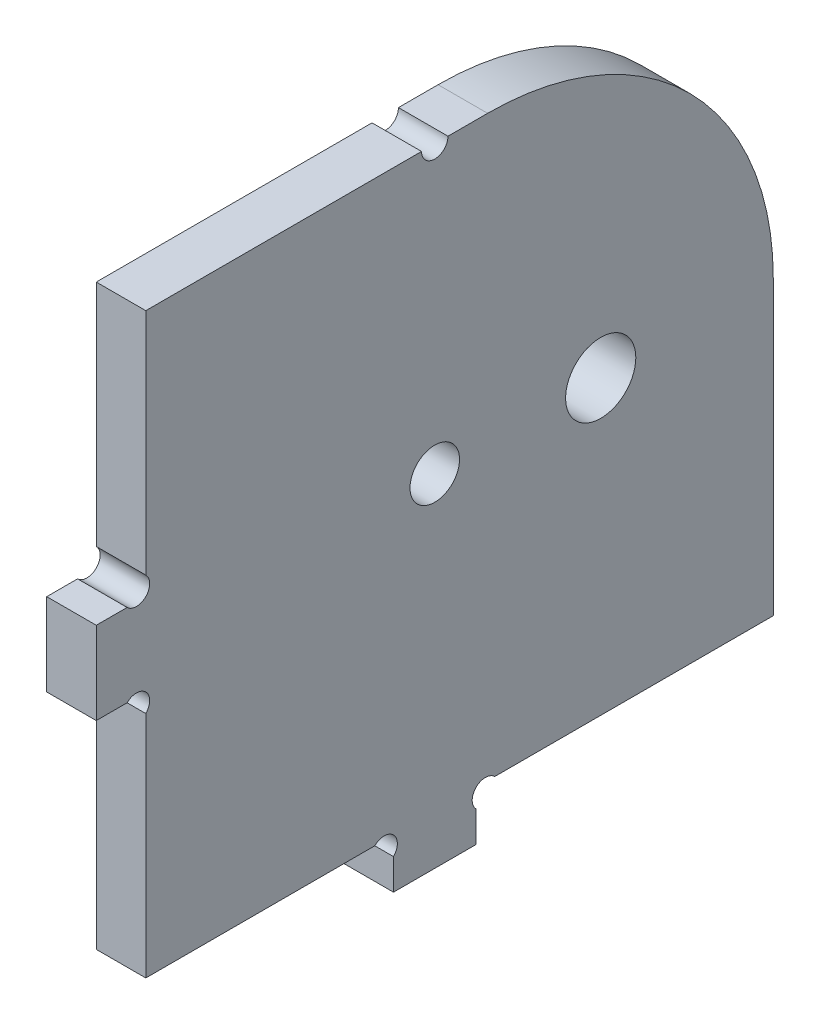
ISO-10303-21;
HEADER;
FILE_DESCRIPTION(('STEP AP214'),'2;1');
FILE_NAME('part.step','',(''),(''),'','','');
FILE_SCHEMA(('AUTOMOTIVE_DESIGN { 1 0 10303 214 1 1 1 1 }'));
ENDSEC;
DATA;
#1=APPLICATION_CONTEXT('core data for automotive mechanical design processes');
#2=APPLICATION_PROTOCOL_DEFINITION('international standard','automotive_design',2000,#1);
#3=PRODUCT_CONTEXT('',#1,'mechanical');
#4=PRODUCT('Part','Part','',(#3));
#5=PRODUCT_RELATED_PRODUCT_CATEGORY('part','',(#4));
#6=PRODUCT_DEFINITION_FORMATION('','',#4);
#7=PRODUCT_DEFINITION_CONTEXT('part definition',#1,'design');
#8=PRODUCT_DEFINITION('design','',#6,#7);
#9=PRODUCT_DEFINITION_SHAPE('','',#8);
#10=(LENGTH_UNIT() NAMED_UNIT(*) SI_UNIT(.MILLI.,.METRE.));
#11=(NAMED_UNIT(*) PLANE_ANGLE_UNIT() SI_UNIT($,.RADIAN.));
#12=(NAMED_UNIT(*) SI_UNIT($,.STERADIAN.) SOLID_ANGLE_UNIT());
#13=UNCERTAINTY_MEASURE_WITH_UNIT(LENGTH_MEASURE(1.E-05),#10,'distance_accuracy_value','');
#14=(GEOMETRIC_REPRESENTATION_CONTEXT(3) GLOBAL_UNCERTAINTY_ASSIGNED_CONTEXT((#13)) GLOBAL_UNIT_ASSIGNED_CONTEXT((#10,
#11,#12)) REPRESENTATION_CONTEXT('',''));
#15=CARTESIAN_POINT('',(0.,0.,0.));
#16=DIRECTION('',(0.,0.,1.));
#17=DIRECTION('',(1.,0.,0.));
#18=AXIS2_PLACEMENT_3D('',#15,#16,#17);
#19=CARTESIAN_POINT('',(6.,4.86862915010152,-47.1313708498985));
#20=DIRECTION('',(1.,0.,0.));
#21=DIRECTION('',(0.,0.,-1.));
#22=AXIS2_PLACEMENT_3D('',#19,#20,#21);
#23=PLANE('',#22);
#24=CARTESIAN_POINT('',(6.,41.4,-41.));
#25=DIRECTION('',(1.,0.,0.));
#26=DIRECTION('',(0.,0.,-1.));
#27=AXIS2_PLACEMENT_3D('',#24,#25,#26);
#28=CIRCLE('',#27,3.);
#29=CARTESIAN_POINT('',(6.,41.4,-44.));
#30=VERTEX_POINT('',#29);
#31=EDGE_CURVE('E199',#30,#30,#28,.T.);
#32=ORIENTED_EDGE('',*,*,#31,.F.);
#33=EDGE_LOOP('',(#32));
#34=FACE_BOUND('',#33,.T.);
#35=CARTESIAN_POINT('',(6.,4.86862915010152,-47.1313708498985));
#36=DIRECTION('',(-1.,0.,0.));
#37=DIRECTION('',(0.,0.,-1.));
#38=AXIS2_PLACEMENT_3D('',#35,#36,#37);
#39=CIRCLE('',#38,1.60000000000001);
#40=CARTESIAN_POINT('',(6.,3.73725830020304,-46.));
#41=VERTEX_POINT('',#40);
#42=CARTESIAN_POINT('',(6.,6.,-48.262741699797));
#43=VERTEX_POINT('',#42);
#44=EDGE_CURVE('E232',#41,#43,#39,.T.);
#45=ORIENTED_EDGE('',*,*,#44,.T.);
#46=DIRECTION('',(0.,0.,-1.));
#47=VECTOR('',#46,1.);
#48=CARTESIAN_POINT('',(6.,6.,-82.));
#49=LINE('',#48,#47);
#50=CARTESIAN_POINT('',(6.,6.,-82.));
#51=VERTEX_POINT('',#50);
#52=EDGE_CURVE('E125',#43,#51,#49,.T.);
#53=ORIENTED_EDGE('',*,*,#52,.T.);
#54=DIRECTION('',(0.,1.,0.));
#55=VECTOR('',#54,1.);
#56=CARTESIAN_POINT('',(6.,41.4,-82.));
#57=LINE('',#56,#55);
#58=CARTESIAN_POINT('',(6.,41.4,-82.));
#59=VERTEX_POINT('',#58);
#60=EDGE_CURVE('E280',#51,#59,#57,.T.);
#61=ORIENTED_EDGE('',*,*,#60,.T.);
#62=CARTESIAN_POINT('',(6.,41.4,-47.4));
#63=DIRECTION('',(1.,0.,0.));
#64=DIRECTION('',(0.,0.,-1.));
#65=AXIS2_PLACEMENT_3D('',#62,#63,#64);
#66=CIRCLE('',#65,34.6);
#67=CARTESIAN_POINT('',(6.,76.,-47.4));
#68=VERTEX_POINT('',#67);
#69=EDGE_CURVE('E299',#59,#68,#66,.T.);
#70=ORIENTED_EDGE('',*,*,#69,.T.);
#71=DIRECTION('',(0.,0.,1.));
#72=VECTOR('',#71,1.);
#73=CARTESIAN_POINT('',(6.,76.,-42.6));
#74=LINE('',#73,#72);
#75=CARTESIAN_POINT('',(6.,76.,-42.6));
#76=VERTEX_POINT('',#75);
#77=EDGE_CURVE('E296',#68,#76,#74,.T.);
#78=ORIENTED_EDGE('',*,*,#77,.T.);
#79=CARTESIAN_POINT('',(6.,76.,-41.));
#80=DIRECTION('',(-1.,0.,0.));
#81=DIRECTION('',(0.,0.,-1.));
#82=AXIS2_PLACEMENT_3D('',#79,#80,#81);
#83=CIRCLE('',#82,1.6);
#84=CARTESIAN_POINT('',(6.,76.,-39.4));
#85=VERTEX_POINT('',#84);
#86=EDGE_CURVE('E298',#76,#85,#83,.T.);
#87=ORIENTED_EDGE('',*,*,#86,.T.);
#88=DIRECTION('',(0.,0.,1.));
#89=VECTOR('',#88,1.);
#90=CARTESIAN_POINT('',(6.,76.,-6.));
#91=LINE('',#90,#89);
#92=CARTESIAN_POINT('',(6.,76.,-6.));
#93=VERTEX_POINT('',#92);
#94=EDGE_CURVE('E301',#85,#93,#91,.T.);
#95=ORIENTED_EDGE('',*,*,#94,.T.);
#96=DIRECTION('',(0.,-1.,0.));
#97=VECTOR('',#96,1.);
#98=CARTESIAN_POINT('',(6.,48.2627416997972,-6.));
#99=LINE('',#98,#97);
#100=CARTESIAN_POINT('',(6.,48.2627416997972,-6.));
#101=VERTEX_POINT('',#100);
#102=EDGE_CURVE('E307',#93,#101,#99,.T.);
#103=ORIENTED_EDGE('',*,*,#102,.T.);
#104=CARTESIAN_POINT('',(6.,47.1313708498986,-4.86862915010136));
#105=DIRECTION('',(-1.,0.,0.));
#106=DIRECTION('',(0.,0.,1.));
#107=AXIS2_PLACEMENT_3D('',#104,#105,#106);
#108=CIRCLE('',#107,1.60000000000023);
#109=CARTESIAN_POINT('',(6.,46.,-3.73725830020272));
#110=VERTEX_POINT('',#109);
#111=EDGE_CURVE('E309',#101,#110,#108,.T.);
#112=ORIENTED_EDGE('',*,*,#111,.T.);
#113=DIRECTION('',(0.,0.,1.));
#114=VECTOR('',#113,1.);
#115=CARTESIAN_POINT('',(6.,46.,0.));
#116=LINE('',#115,#114);
#117=CARTESIAN_POINT('',(6.,46.,0.));
#118=VERTEX_POINT('',#117);
#119=EDGE_CURVE('E311',#110,#118,#116,.T.);
#120=ORIENTED_EDGE('',*,*,#119,.T.);
#121=DIRECTION('',(0.,-1.,0.));
#122=VECTOR('',#121,1.);
#123=CARTESIAN_POINT('',(6.,36.,0.));
#124=LINE('',#123,#122);
#125=CARTESIAN_POINT('',(6.,36.,0.));
#126=VERTEX_POINT('',#125);
#127=EDGE_CURVE('E313',#118,#126,#124,.T.);
#128=ORIENTED_EDGE('',*,*,#127,.T.);
#129=DIRECTION('',(0.,0.,-1.));
#130=VECTOR('',#129,1.);
#131=CARTESIAN_POINT('',(6.,36.,-3.73725830020257));
#132=LINE('',#131,#130);
#133=CARTESIAN_POINT('',(6.,36.,-3.73725830020257));
#134=VERTEX_POINT('',#133);
#135=EDGE_CURVE('E315',#126,#134,#132,.T.);
#136=ORIENTED_EDGE('',*,*,#135,.T.);
#137=CARTESIAN_POINT('',(6.,34.8686291501013,-4.86862915010128));
#138=DIRECTION('',(-1.,0.,0.));
#139=DIRECTION('',(0.,0.,-1.));
#140=AXIS2_PLACEMENT_3D('',#137,#138,#139);
#141=CIRCLE('',#140,1.60000000000033);
#142=CARTESIAN_POINT('',(6.,33.7372583002026,-6.));
#143=VERTEX_POINT('',#142);
#144=EDGE_CURVE('E317',#134,#143,#141,.T.);
#145=ORIENTED_EDGE('',*,*,#144,.T.);
#146=DIRECTION('',(0.,-1.,0.));
#147=VECTOR('',#146,1.);
#148=CARTESIAN_POINT('',(6.,6.,-6.));
#149=LINE('',#148,#147);
#150=CARTESIAN_POINT('',(6.,6.,-6.));
#151=VERTEX_POINT('',#150);
#152=EDGE_CURVE('E319',#143,#151,#149,.T.);
#153=ORIENTED_EDGE('',*,*,#152,.T.);
#154=DIRECTION('',(0.,0.,-1.));
#155=VECTOR('',#154,1.);
#156=CARTESIAN_POINT('',(6.,6.,-33.7372583002031));
#157=LINE('',#156,#155);
#158=CARTESIAN_POINT('',(6.,6.,-33.7372583002031));
#159=VERTEX_POINT('',#158);
#160=EDGE_CURVE('E321',#151,#159,#157,.T.);
#161=ORIENTED_EDGE('',*,*,#160,.T.);
#162=CARTESIAN_POINT('',(6.,4.86862915010151,-34.8686291501015));
#163=DIRECTION('',(-1.,0.,0.));
#164=DIRECTION('',(0.,0.,1.));
#165=AXIS2_PLACEMENT_3D('',#162,#163,#164);
#166=CIRCLE('',#165,1.60000000000001);
#167=CARTESIAN_POINT('',(6.,3.73725830020304,-36.));
#168=VERTEX_POINT('',#167);
#169=EDGE_CURVE('E177',#159,#168,#166,.T.);
#170=ORIENTED_EDGE('',*,*,#169,.T.);
#171=DIRECTION('',(0.,-1.,0.));
#172=VECTOR('',#171,1.);
#173=CARTESIAN_POINT('',(6.,0.,-36.));
#174=LINE('',#173,#172);
#175=CARTESIAN_POINT('',(6.,0.,-36.));
#176=VERTEX_POINT('',#175);
#177=EDGE_CURVE('E171',#168,#176,#174,.T.);
#178=ORIENTED_EDGE('',*,*,#177,.T.);
#179=DIRECTION('',(0.,0.,-1.));
#180=VECTOR('',#179,1.);
#181=CARTESIAN_POINT('',(6.,0.,-46.));
#182=LINE('',#181,#180);
#183=CARTESIAN_POINT('',(6.,0.,-46.));
#184=VERTEX_POINT('',#183);
#185=EDGE_CURVE('E175',#176,#184,#182,.T.);
#186=ORIENTED_EDGE('',*,*,#185,.T.);
#187=DIRECTION('',(0.,1.,0.));
#188=VECTOR('',#187,1.);
#189=CARTESIAN_POINT('',(6.,3.73725830020304,-46.));
#190=LINE('',#189,#188);
#191=EDGE_CURVE('E49',#184,#41,#190,.T.);
#192=ORIENTED_EDGE('',*,*,#191,.T.);
#193=EDGE_LOOP('',(#45,#53,#61,#70,#78,#87,#95,#103,#112,#120,#128,#136,#145,#153,#161,#170,
#178,#186,#192));
#194=FACE_BOUND('',#193,.T.);
#195=CARTESIAN_POINT('',(6.,41.4,-61.1));
#196=DIRECTION('',(1.,0.,0.));
#197=DIRECTION('',(0.,0.,-1.));
#198=AXIS2_PLACEMENT_3D('',#195,#196,#197);
#199=CIRCLE('',#198,4.25000000000001);
#200=CARTESIAN_POINT('',(6.,41.4,-65.35));
#201=VERTEX_POINT('',#200);
#202=EDGE_CURVE('E364',#201,#201,#199,.T.);
#203=ORIENTED_EDGE('',*,*,#202,.F.);
#204=EDGE_LOOP('',(#203));
#205=FACE_BOUND('',#204,.T.);
#206=ADVANCED_FACE('F32',(#34,#194,#205),#23,.T.);
#207=CARTESIAN_POINT('',(0.,4.86862915010152,-47.1313708498985));
#208=DIRECTION('',(1.,0.,0.));
#209=DIRECTION('',(0.,0.,-1.));
#210=AXIS2_PLACEMENT_3D('',#207,#208,#209);
#211=PLANE('',#210);
#212=CARTESIAN_POINT('',(0.,41.4,-41.));
#213=DIRECTION('',(1.,0.,0.));
#214=DIRECTION('',(0.,0.,-1.));
#215=AXIS2_PLACEMENT_3D('',#212,#213,#214);
#216=CIRCLE('',#215,3.);
#217=CARTESIAN_POINT('',(0.,41.4,-44.));
#218=VERTEX_POINT('',#217);
#219=EDGE_CURVE('E369',#218,#218,#216,.T.);
#220=ORIENTED_EDGE('',*,*,#219,.T.);
#221=EDGE_LOOP('',(#220));
#222=FACE_BOUND('',#221,.T.);
#223=CARTESIAN_POINT('',(0.,4.86862915010152,-47.1313708498985));
#224=DIRECTION('',(-1.,0.,0.));
#225=DIRECTION('',(0.,0.,-1.));
#226=AXIS2_PLACEMENT_3D('',#223,#224,#225);
#227=CIRCLE('',#226,1.60000000000001);
#228=CARTESIAN_POINT('',(0.,3.73725830020304,-46.));
#229=VERTEX_POINT('',#228);
#230=CARTESIAN_POINT('',(0.,6.,-48.262741699797));
#231=VERTEX_POINT('',#230);
#232=EDGE_CURVE('E195',#229,#231,#227,.T.);
#233=ORIENTED_EDGE('',*,*,#232,.F.);
#234=DIRECTION('',(0.,1.,0.));
#235=VECTOR('',#234,1.);
#236=CARTESIAN_POINT('',(0.,3.73725830020304,-46.));
#237=LINE('',#236,#235);
#238=CARTESIAN_POINT('',(0.,0.,-46.));
#239=VERTEX_POINT('',#238);
#240=EDGE_CURVE('E117',#239,#229,#237,.T.);
#241=ORIENTED_EDGE('',*,*,#240,.F.);
#242=DIRECTION('',(0.,0.,-1.));
#243=VECTOR('',#242,1.);
#244=CARTESIAN_POINT('',(0.,0.,-46.));
#245=LINE('',#244,#243);
#246=CARTESIAN_POINT('',(0.,0.,-36.));
#247=VERTEX_POINT('',#246);
#248=EDGE_CURVE('E111',#247,#239,#245,.T.);
#249=ORIENTED_EDGE('',*,*,#248,.F.);
#250=DIRECTION('',(0.,-1.,0.));
#251=VECTOR('',#250,1.);
#252=CARTESIAN_POINT('',(0.,0.,-36.));
#253=LINE('',#252,#251);
#254=CARTESIAN_POINT('',(0.,3.73725830020304,-36.));
#255=VERTEX_POINT('',#254);
#256=EDGE_CURVE('E185',#255,#247,#253,.T.);
#257=ORIENTED_EDGE('',*,*,#256,.F.);
#258=CARTESIAN_POINT('',(0.,4.86862915010151,-34.8686291501015));
#259=DIRECTION('',(-1.,0.,0.));
#260=DIRECTION('',(0.,0.,1.));
#261=AXIS2_PLACEMENT_3D('',#258,#259,#260);
#262=CIRCLE('',#261,1.60000000000001);
#263=CARTESIAN_POINT('',(0.,6.,-33.7372583002031));
#264=VERTEX_POINT('',#263);
#265=EDGE_CURVE('E227',#264,#255,#262,.T.);
#266=ORIENTED_EDGE('',*,*,#265,.F.);
#267=DIRECTION('',(0.,0.,-1.));
#268=VECTOR('',#267,1.);
#269=CARTESIAN_POINT('',(0.,6.,-33.7372583002031));
#270=LINE('',#269,#268);
#271=CARTESIAN_POINT('',(0.,6.,-6.));
#272=VERTEX_POINT('',#271);
#273=EDGE_CURVE('E225',#272,#264,#270,.T.);
#274=ORIENTED_EDGE('',*,*,#273,.F.);
#275=DIRECTION('',(0.,-1.,0.));
#276=VECTOR('',#275,1.);
#277=CARTESIAN_POINT('',(0.,6.,-6.));
#278=LINE('',#277,#276);
#279=CARTESIAN_POINT('',(0.,33.7372583002026,-6.));
#280=VERTEX_POINT('',#279);
#281=EDGE_CURVE('E223',#280,#272,#278,.T.);
#282=ORIENTED_EDGE('',*,*,#281,.F.);
#283=CARTESIAN_POINT('',(0.,34.8686291501013,-4.86862915010128));
#284=DIRECTION('',(-1.,0.,0.));
#285=DIRECTION('',(0.,0.,-1.));
#286=AXIS2_PLACEMENT_3D('',#283,#284,#285);
#287=CIRCLE('',#286,1.60000000000033);
#288=CARTESIAN_POINT('',(0.,36.,-3.73725830020257));
#289=VERTEX_POINT('',#288);
#290=EDGE_CURVE('E221',#289,#280,#287,.T.);
#291=ORIENTED_EDGE('',*,*,#290,.F.);
#292=DIRECTION('',(0.,0.,-1.));
#293=VECTOR('',#292,1.);
#294=CARTESIAN_POINT('',(0.,36.,-3.73725830020257));
#295=LINE('',#294,#293);
#296=CARTESIAN_POINT('',(0.,36.,0.));
#297=VERTEX_POINT('',#296);
#298=EDGE_CURVE('E219',#297,#289,#295,.T.);
#299=ORIENTED_EDGE('',*,*,#298,.F.);
#300=DIRECTION('',(0.,-1.,0.));
#301=VECTOR('',#300,1.);
#302=CARTESIAN_POINT('',(0.,36.,0.));
#303=LINE('',#302,#301);
#304=CARTESIAN_POINT('',(0.,46.,0.));
#305=VERTEX_POINT('',#304);
#306=EDGE_CURVE('E217',#305,#297,#303,.T.);
#307=ORIENTED_EDGE('',*,*,#306,.F.);
#308=DIRECTION('',(0.,0.,1.));
#309=VECTOR('',#308,1.);
#310=CARTESIAN_POINT('',(0.,46.,0.));
#311=LINE('',#310,#309);
#312=CARTESIAN_POINT('',(0.,46.,-3.73725830020272));
#313=VERTEX_POINT('',#312);
#314=EDGE_CURVE('E215',#313,#305,#311,.T.);
#315=ORIENTED_EDGE('',*,*,#314,.F.);
#316=CARTESIAN_POINT('',(0.,47.1313708498986,-4.86862915010136));
#317=DIRECTION('',(-1.,0.,0.));
#318=DIRECTION('',(0.,0.,1.));
#319=AXIS2_PLACEMENT_3D('',#316,#317,#318);
#320=CIRCLE('',#319,1.60000000000023);
#321=CARTESIAN_POINT('',(0.,48.2627416997972,-6.));
#322=VERTEX_POINT('',#321);
#323=EDGE_CURVE('E213',#322,#313,#320,.T.);
#324=ORIENTED_EDGE('',*,*,#323,.F.);
#325=DIRECTION('',(0.,-1.,0.));
#326=VECTOR('',#325,1.);
#327=CARTESIAN_POINT('',(0.,48.2627416997972,-6.));
#328=LINE('',#327,#326);
#329=CARTESIAN_POINT('',(0.,76.,-6.));
#330=VERTEX_POINT('',#329);
#331=EDGE_CURVE('E211',#330,#322,#328,.T.);
#332=ORIENTED_EDGE('',*,*,#331,.F.);
#333=DIRECTION('',(0.,0.,1.));
#334=VECTOR('',#333,1.);
#335=CARTESIAN_POINT('',(0.,76.,-6.));
#336=LINE('',#335,#334);
#337=CARTESIAN_POINT('',(0.,76.,-39.4));
#338=VERTEX_POINT('',#337);
#339=EDGE_CURVE('E209',#338,#330,#336,.T.);
#340=ORIENTED_EDGE('',*,*,#339,.F.);
#341=CARTESIAN_POINT('',(0.,76.,-41.));
#342=DIRECTION('',(-1.,0.,0.));
#343=DIRECTION('',(0.,0.,-1.));
#344=AXIS2_PLACEMENT_3D('',#341,#342,#343);
#345=CIRCLE('',#344,1.6);
#346=CARTESIAN_POINT('',(0.,76.,-42.6));
#347=VERTEX_POINT('',#346);
#348=EDGE_CURVE('E207',#347,#338,#345,.T.);
#349=ORIENTED_EDGE('',*,*,#348,.F.);
#350=DIRECTION('',(0.,0.,1.));
#351=VECTOR('',#350,1.);
#352=CARTESIAN_POINT('',(0.,76.,-42.6));
#353=LINE('',#352,#351);
#354=CARTESIAN_POINT('',(0.,76.,-47.4));
#355=VERTEX_POINT('',#354);
#356=EDGE_CURVE('E205',#355,#347,#353,.T.);
#357=ORIENTED_EDGE('',*,*,#356,.F.);
#358=CARTESIAN_POINT('',(0.,41.4,-47.4));
#359=DIRECTION('',(1.,0.,0.));
#360=DIRECTION('',(0.,0.,-1.));
#361=AXIS2_PLACEMENT_3D('',#358,#359,#360);
#362=CIRCLE('',#361,34.6);
#363=CARTESIAN_POINT('',(0.,41.4,-82.));
#364=VERTEX_POINT('',#363);
#365=EDGE_CURVE('E203',#364,#355,#362,.T.);
#366=ORIENTED_EDGE('',*,*,#365,.F.);
#367=DIRECTION('',(0.,1.,0.));
#368=VECTOR('',#367,1.);
#369=CARTESIAN_POINT('',(0.,41.4,-82.));
#370=LINE('',#369,#368);
#371=CARTESIAN_POINT('',(0.,6.,-82.));
#372=VERTEX_POINT('',#371);
#373=EDGE_CURVE('E201',#372,#364,#370,.T.);
#374=ORIENTED_EDGE('',*,*,#373,.F.);
#375=DIRECTION('',(0.,0.,-1.));
#376=VECTOR('',#375,1.);
#377=CARTESIAN_POINT('',(0.,6.,-82.));
#378=LINE('',#377,#376);
#379=EDGE_CURVE('E198',#231,#372,#378,.T.);
#380=ORIENTED_EDGE('',*,*,#379,.F.);
#381=EDGE_LOOP('',(#233,#241,#249,#257,#266,#274,#282,#291,#299,#307,#315,#324,#332,#340,#349,
#357,#366,#374,#380));
#382=FACE_BOUND('',#381,.T.);
#383=CARTESIAN_POINT('',(0.,41.4,-61.1));
#384=DIRECTION('',(1.,0.,0.));
#385=DIRECTION('',(0.,0.,-1.));
#386=AXIS2_PLACEMENT_3D('',#383,#384,#385);
#387=CIRCLE('',#386,4.25000000000001);
#388=CARTESIAN_POINT('',(0.,41.4,-65.35));
#389=VERTEX_POINT('',#388);
#390=EDGE_CURVE('E367',#389,#389,#387,.T.);
#391=ORIENTED_EDGE('',*,*,#390,.T.);
#392=EDGE_LOOP('',(#391));
#393=FACE_BOUND('',#392,.T.);
#394=ADVANCED_FACE('F284',(#222,#382,#393),#211,.F.);
#395=CARTESIAN_POINT('',(6.,4.86862915010152,-47.1313708498985));
#396=DIRECTION('',(-1.,0.,0.));
#397=DIRECTION('',(0.,0.,1.));
#398=AXIS2_PLACEMENT_3D('',#395,#396,#397);
#399=CYLINDRICAL_SURFACE('',#398,1.60000000000001);
#400=ORIENTED_EDGE('',*,*,#232,.T.);
#401=DIRECTION('',(-1.,0.,0.));
#402=VECTOR('',#401,1.);
#403=CARTESIAN_POINT('',(6.,6.,-48.262741699797));
#404=LINE('',#403,#402);
#405=EDGE_CURVE('E11',#43,#231,#404,.T.);
#406=ORIENTED_EDGE('',*,*,#405,.F.);
#407=ORIENTED_EDGE('',*,*,#44,.F.);
#408=DIRECTION('',(-1.,0.,0.));
#409=VECTOR('',#408,1.);
#410=CARTESIAN_POINT('',(6.,3.73725830020304,-46.));
#411=LINE('',#410,#409);
#412=EDGE_CURVE('E191',#41,#229,#411,.T.);
#413=ORIENTED_EDGE('',*,*,#412,.T.);
#414=EDGE_LOOP('',(#400,#406,#407,#413));
#415=FACE_BOUND('',#414,.T.);
#416=ADVANCED_FACE('F34',(#415),#399,.F.);
#417=CARTESIAN_POINT('',(6.,6.,-82.));
#418=DIRECTION('',(0.,1.,0.));
#419=DIRECTION('',(0.,0.,1.));
#420=AXIS2_PLACEMENT_3D('',#417,#418,#419);
#421=PLANE('',#420);
#422=ORIENTED_EDGE('',*,*,#379,.T.);
#423=DIRECTION('',(-1.,0.,0.));
#424=VECTOR('',#423,1.);
#425=CARTESIAN_POINT('',(6.,6.,-82.));
#426=LINE('',#425,#424);
#427=EDGE_CURVE('E41',#51,#372,#426,.T.);
#428=ORIENTED_EDGE('',*,*,#427,.F.);
#429=ORIENTED_EDGE('',*,*,#52,.F.);
#430=ORIENTED_EDGE('',*,*,#405,.T.);
#431=EDGE_LOOP('',(#422,#428,#429,#430));
#432=FACE_BOUND('',#431,.T.);
#433=ADVANCED_FACE('F532',(#432),#421,.F.);
#434=CARTESIAN_POINT('',(6.,41.4,-82.));
#435=DIRECTION('',(0.,0.,1.));
#436=DIRECTION('',(1.,0.,0.));
#437=AXIS2_PLACEMENT_3D('',#434,#435,#436);
#438=PLANE('',#437);
#439=ORIENTED_EDGE('',*,*,#373,.T.);
#440=DIRECTION('',(-1.,0.,0.));
#441=VECTOR('',#440,1.);
#442=CARTESIAN_POINT('',(6.,41.4,-82.));
#443=LINE('',#442,#441);
#444=EDGE_CURVE('E272',#59,#364,#443,.T.);
#445=ORIENTED_EDGE('',*,*,#444,.F.);
#446=ORIENTED_EDGE('',*,*,#60,.F.);
#447=ORIENTED_EDGE('',*,*,#427,.T.);
#448=EDGE_LOOP('',(#439,#445,#446,#447));
#449=FACE_BOUND('',#448,.T.);
#450=ADVANCED_FACE('F278',(#449),#438,.F.);
#451=CARTESIAN_POINT('',(6.,41.4,-47.4));
#452=DIRECTION('',(-1.,0.,0.));
#453=DIRECTION('',(0.,0.,1.));
#454=AXIS2_PLACEMENT_3D('',#451,#452,#453);
#455=CYLINDRICAL_SURFACE('',#454,34.6);
#456=ORIENTED_EDGE('',*,*,#365,.T.);
#457=DIRECTION('',(-1.,0.,0.));
#458=VECTOR('',#457,1.);
#459=CARTESIAN_POINT('',(6.,76.,-47.4));
#460=LINE('',#459,#458);
#461=EDGE_CURVE('E269',#68,#355,#460,.T.);
#462=ORIENTED_EDGE('',*,*,#461,.F.);
#463=ORIENTED_EDGE('',*,*,#69,.F.);
#464=ORIENTED_EDGE('',*,*,#444,.T.);
#465=EDGE_LOOP('',(#456,#462,#463,#464));
#466=FACE_BOUND('',#465,.T.);
#467=ADVANCED_FACE('F290',(#466),#455,.T.);
#468=CARTESIAN_POINT('',(6.,76.,-42.6));
#469=DIRECTION('',(0.,-1.,0.));
#470=DIRECTION('',(0.,0.,-1.));
#471=AXIS2_PLACEMENT_3D('',#468,#469,#470);
#472=PLANE('',#471);
#473=ORIENTED_EDGE('',*,*,#356,.T.);
#474=DIRECTION('',(-1.,0.,0.));
#475=VECTOR('',#474,1.);
#476=CARTESIAN_POINT('',(6.,76.,-42.6));
#477=LINE('',#476,#475);
#478=EDGE_CURVE('E266',#76,#347,#477,.T.);
#479=ORIENTED_EDGE('',*,*,#478,.F.);
#480=ORIENTED_EDGE('',*,*,#77,.F.);
#481=ORIENTED_EDGE('',*,*,#461,.T.);
#482=EDGE_LOOP('',(#473,#479,#480,#481));
#483=FACE_BOUND('',#482,.T.);
#484=ADVANCED_FACE('F294',(#483),#472,.F.);
#485=CARTESIAN_POINT('',(6.,76.,-41.));
#486=DIRECTION('',(-1.,0.,0.));
#487=DIRECTION('',(0.,0.,1.));
#488=AXIS2_PLACEMENT_3D('',#485,#486,#487);
#489=CYLINDRICAL_SURFACE('',#488,1.6);
#490=ORIENTED_EDGE('',*,*,#348,.T.);
#491=DIRECTION('',(-1.,0.,0.));
#492=VECTOR('',#491,1.);
#493=CARTESIAN_POINT('',(6.,76.,-39.4));
#494=LINE('',#493,#492);
#495=EDGE_CURVE('E263',#85,#338,#494,.T.);
#496=ORIENTED_EDGE('',*,*,#495,.F.);
#497=ORIENTED_EDGE('',*,*,#86,.F.);
#498=ORIENTED_EDGE('',*,*,#478,.T.);
#499=EDGE_LOOP('',(#490,#496,#497,#498));
#500=FACE_BOUND('',#499,.T.);
#501=ADVANCED_FACE('F497',(#500),#489,.F.);
#502=CARTESIAN_POINT('',(6.,76.,-6.));
#503=DIRECTION('',(0.,-1.,0.));
#504=DIRECTION('',(0.,0.,-1.));
#505=AXIS2_PLACEMENT_3D('',#502,#503,#504);
#506=PLANE('',#505);
#507=ORIENTED_EDGE('',*,*,#339,.T.);
#508=DIRECTION('',(-1.,0.,0.));
#509=VECTOR('',#508,1.);
#510=CARTESIAN_POINT('',(6.,76.,-6.));
#511=LINE('',#510,#509);
#512=EDGE_CURVE('E260',#93,#330,#511,.T.);
#513=ORIENTED_EDGE('',*,*,#512,.F.);
#514=ORIENTED_EDGE('',*,*,#94,.F.);
#515=ORIENTED_EDGE('',*,*,#495,.T.);
#516=EDGE_LOOP('',(#507,#513,#514,#515));
#517=FACE_BOUND('',#516,.T.);
#518=ADVANCED_FACE('F487',(#517),#506,.F.);
#519=CARTESIAN_POINT('',(6.,48.2627416997972,-6.));
#520=DIRECTION('',(0.,0.,-1.));
#521=DIRECTION('',(-1.,0.,0.));
#522=AXIS2_PLACEMENT_3D('',#519,#520,#521);
#523=PLANE('',#522);
#524=ORIENTED_EDGE('',*,*,#331,.T.);
#525=DIRECTION('',(-1.,0.,0.));
#526=VECTOR('',#525,1.);
#527=CARTESIAN_POINT('',(6.,48.2627416997972,-6.));
#528=LINE('',#527,#526);
#529=EDGE_CURVE('E257',#101,#322,#528,.T.);
#530=ORIENTED_EDGE('',*,*,#529,.F.);
#531=ORIENTED_EDGE('',*,*,#102,.F.);
#532=ORIENTED_EDGE('',*,*,#512,.T.);
#533=EDGE_LOOP('',(#524,#530,#531,#532));
#534=FACE_BOUND('',#533,.T.);
#535=ADVANCED_FACE('F477',(#534),#523,.F.);
#536=CARTESIAN_POINT('',(6.,47.1313708498986,-4.86862915010136));
#537=DIRECTION('',(-1.,0.,0.));
#538=DIRECTION('',(0.,0.,1.));
#539=AXIS2_PLACEMENT_3D('',#536,#537,#538);
#540=CYLINDRICAL_SURFACE('',#539,1.60000000000023);
#541=ORIENTED_EDGE('',*,*,#323,.T.);
#542=DIRECTION('',(-1.,0.,0.));
#543=VECTOR('',#542,1.);
#544=CARTESIAN_POINT('',(6.,46.,-3.73725830020272));
#545=LINE('',#544,#543);
#546=EDGE_CURVE('E254',#110,#313,#545,.T.);
#547=ORIENTED_EDGE('',*,*,#546,.F.);
#548=ORIENTED_EDGE('',*,*,#111,.F.);
#549=ORIENTED_EDGE('',*,*,#529,.T.);
#550=EDGE_LOOP('',(#541,#547,#548,#549));
#551=FACE_BOUND('',#550,.T.);
#552=ADVANCED_FACE('F467',(#551),#540,.F.);
#553=CARTESIAN_POINT('',(6.,46.,0.));
#554=DIRECTION('',(0.,-1.,0.));
#555=DIRECTION('',(0.,0.,-1.));
#556=AXIS2_PLACEMENT_3D('',#553,#554,#555);
#557=PLANE('',#556);
#558=ORIENTED_EDGE('',*,*,#314,.T.);
#559=DIRECTION('',(-1.,0.,0.));
#560=VECTOR('',#559,1.);
#561=CARTESIAN_POINT('',(6.,46.,0.));
#562=LINE('',#561,#560);
#563=EDGE_CURVE('E251',#118,#305,#562,.T.);
#564=ORIENTED_EDGE('',*,*,#563,.F.);
#565=ORIENTED_EDGE('',*,*,#119,.F.);
#566=ORIENTED_EDGE('',*,*,#546,.T.);
#567=EDGE_LOOP('',(#558,#564,#565,#566));
#568=FACE_BOUND('',#567,.T.);
#569=ADVANCED_FACE('F457',(#568),#557,.F.);
#570=CARTESIAN_POINT('',(6.,36.,0.));
#571=DIRECTION('',(0.,0.,-1.));
#572=DIRECTION('',(-1.,0.,0.));
#573=AXIS2_PLACEMENT_3D('',#570,#571,#572);
#574=PLANE('',#573);
#575=ORIENTED_EDGE('',*,*,#306,.T.);
#576=DIRECTION('',(-1.,0.,0.));
#577=VECTOR('',#576,1.);
#578=CARTESIAN_POINT('',(6.,36.,0.));
#579=LINE('',#578,#577);
#580=EDGE_CURVE('E248',#126,#297,#579,.T.);
#581=ORIENTED_EDGE('',*,*,#580,.F.);
#582=ORIENTED_EDGE('',*,*,#127,.F.);
#583=ORIENTED_EDGE('',*,*,#563,.T.);
#584=EDGE_LOOP('',(#575,#581,#582,#583));
#585=FACE_BOUND('',#584,.T.);
#586=ADVANCED_FACE('F447',(#585),#574,.F.);
#587=CARTESIAN_POINT('',(6.,36.,-3.73725830020257));
#588=DIRECTION('',(0.,1.,0.));
#589=DIRECTION('',(0.,0.,1.));
#590=AXIS2_PLACEMENT_3D('',#587,#588,#589);
#591=PLANE('',#590);
#592=ORIENTED_EDGE('',*,*,#298,.T.);
#593=DIRECTION('',(-1.,0.,0.));
#594=VECTOR('',#593,1.);
#595=CARTESIAN_POINT('',(6.,36.,-3.73725830020257));
#596=LINE('',#595,#594);
#597=EDGE_CURVE('E245',#134,#289,#596,.T.);
#598=ORIENTED_EDGE('',*,*,#597,.F.);
#599=ORIENTED_EDGE('',*,*,#135,.F.);
#600=ORIENTED_EDGE('',*,*,#580,.T.);
#601=EDGE_LOOP('',(#592,#598,#599,#600));
#602=FACE_BOUND('',#601,.T.);
#603=ADVANCED_FACE('F437',(#602),#591,.F.);
#604=CARTESIAN_POINT('',(6.,34.8686291501013,-4.86862915010128));
#605=DIRECTION('',(-1.,0.,0.));
#606=DIRECTION('',(0.,0.,1.));
#607=AXIS2_PLACEMENT_3D('',#604,#605,#606);
#608=CYLINDRICAL_SURFACE('',#607,1.60000000000033);
#609=ORIENTED_EDGE('',*,*,#290,.T.);
#610=DIRECTION('',(-1.,0.,0.));
#611=VECTOR('',#610,1.);
#612=CARTESIAN_POINT('',(6.,33.7372583002026,-6.));
#613=LINE('',#612,#611);
#614=EDGE_CURVE('E242',#143,#280,#613,.T.);
#615=ORIENTED_EDGE('',*,*,#614,.F.);
#616=ORIENTED_EDGE('',*,*,#144,.F.);
#617=ORIENTED_EDGE('',*,*,#597,.T.);
#618=EDGE_LOOP('',(#609,#615,#616,#617));
#619=FACE_BOUND('',#618,.T.);
#620=ADVANCED_FACE('F427',(#619),#608,.F.);
#621=CARTESIAN_POINT('',(6.,6.,-6.));
#622=DIRECTION('',(0.,0.,-1.));
#623=DIRECTION('',(0.,1.,0.));
#624=AXIS2_PLACEMENT_3D('',#621,#622,#623);
#625=PLANE('',#624);
#626=ORIENTED_EDGE('',*,*,#281,.T.);
#627=DIRECTION('',(-1.,0.,0.));
#628=VECTOR('',#627,1.);
#629=CARTESIAN_POINT('',(6.,6.,-6.));
#630=LINE('',#629,#628);
#631=EDGE_CURVE('E239',#151,#272,#630,.T.);
#632=ORIENTED_EDGE('',*,*,#631,.F.);
#633=ORIENTED_EDGE('',*,*,#152,.F.);
#634=ORIENTED_EDGE('',*,*,#614,.T.);
#635=EDGE_LOOP('',(#626,#632,#633,#634));
#636=FACE_BOUND('',#635,.T.);
#637=ADVANCED_FACE('F418',(#636),#625,.F.);
#638=CARTESIAN_POINT('',(6.,6.,-33.7372583002031));
#639=DIRECTION('',(0.,1.,0.));
#640=DIRECTION('',(0.,0.,1.));
#641=AXIS2_PLACEMENT_3D('',#638,#639,#640);
#642=PLANE('',#641);
#643=ORIENTED_EDGE('',*,*,#273,.T.);
#644=DIRECTION('',(-1.,0.,0.));
#645=VECTOR('',#644,1.);
#646=CARTESIAN_POINT('',(6.,6.,-33.7372583002031));
#647=LINE('',#646,#645);
#648=EDGE_CURVE('E236',#159,#264,#647,.T.);
#649=ORIENTED_EDGE('',*,*,#648,.F.);
#650=ORIENTED_EDGE('',*,*,#160,.F.);
#651=ORIENTED_EDGE('',*,*,#631,.T.);
#652=EDGE_LOOP('',(#643,#649,#650,#651));
#653=FACE_BOUND('',#652,.T.);
#654=ADVANCED_FACE('F327',(#653),#642,.F.);
#655=CARTESIAN_POINT('',(6.,4.86862915010151,-34.8686291501015));
#656=DIRECTION('',(-1.,0.,0.));
#657=DIRECTION('',(0.,0.,1.));
#658=AXIS2_PLACEMENT_3D('',#655,#656,#657);
#659=CYLINDRICAL_SURFACE('',#658,1.60000000000001);
#660=ORIENTED_EDGE('',*,*,#265,.T.);
#661=DIRECTION('',(-1.,0.,0.));
#662=VECTOR('',#661,1.);
#663=CARTESIAN_POINT('',(6.,3.73725830020304,-36.));
#664=LINE('',#663,#662);
#665=EDGE_CURVE('E186',#168,#255,#664,.T.);
#666=ORIENTED_EDGE('',*,*,#665,.F.);
#667=ORIENTED_EDGE('',*,*,#169,.F.);
#668=ORIENTED_EDGE('',*,*,#648,.T.);
#669=EDGE_LOOP('',(#660,#666,#667,#668));
#670=FACE_BOUND('',#669,.T.);
#671=ADVANCED_FACE('F331',(#670),#659,.F.);
#672=CARTESIAN_POINT('',(6.,0.,-36.));
#673=DIRECTION('',(0.,0.,-1.));
#674=DIRECTION('',(0.,1.,0.));
#675=AXIS2_PLACEMENT_3D('',#672,#673,#674);
#676=PLANE('',#675);
#677=ORIENTED_EDGE('',*,*,#256,.T.);
#678=DIRECTION('',(-1.,0.,0.));
#679=VECTOR('',#678,1.);
#680=CARTESIAN_POINT('',(6.,0.,-36.));
#681=LINE('',#680,#679);
#682=EDGE_CURVE('E182',#176,#247,#681,.T.);
#683=ORIENTED_EDGE('',*,*,#682,.F.);
#684=ORIENTED_EDGE('',*,*,#177,.F.);
#685=ORIENTED_EDGE('',*,*,#665,.T.);
#686=EDGE_LOOP('',(#677,#683,#684,#685));
#687=FACE_BOUND('',#686,.T.);
#688=ADVANCED_FACE('F183',(#687),#676,.F.);
#689=CARTESIAN_POINT('',(6.,0.,-46.));
#690=DIRECTION('',(0.,1.,0.));
#691=DIRECTION('',(0.,0.,1.));
#692=AXIS2_PLACEMENT_3D('',#689,#690,#691);
#693=PLANE('',#692);
#694=ORIENTED_EDGE('',*,*,#248,.T.);
#695=DIRECTION('',(-1.,0.,0.));
#696=VECTOR('',#695,1.);
#697=CARTESIAN_POINT('',(6.,0.,-46.));
#698=LINE('',#697,#696);
#699=EDGE_CURVE('E187',#184,#239,#698,.T.);
#700=ORIENTED_EDGE('',*,*,#699,.F.);
#701=ORIENTED_EDGE('',*,*,#185,.F.);
#702=ORIENTED_EDGE('',*,*,#682,.T.);
#703=EDGE_LOOP('',(#694,#700,#701,#702));
#704=FACE_BOUND('',#703,.T.);
#705=ADVANCED_FACE('F189',(#704),#693,.F.);
#706=CARTESIAN_POINT('',(6.,3.73725830020304,-46.));
#707=DIRECTION('',(0.,0.,1.));
#708=DIRECTION('',(1.,0.,0.));
#709=AXIS2_PLACEMENT_3D('',#706,#707,#708);
#710=PLANE('',#709);
#711=ORIENTED_EDGE('',*,*,#240,.T.);
#712=ORIENTED_EDGE('',*,*,#412,.F.);
#713=ORIENTED_EDGE('',*,*,#191,.F.);
#714=ORIENTED_EDGE('',*,*,#699,.T.);
#715=EDGE_LOOP('',(#711,#712,#713,#714));
#716=FACE_BOUND('',#715,.T.);
#717=ADVANCED_FACE('F335',(#716),#710,.F.);
#718=CARTESIAN_POINT('',(6.,41.4,-41.));
#719=DIRECTION('',(-1.,0.,0.));
#720=DIRECTION('',(0.,0.,1.));
#721=AXIS2_PLACEMENT_3D('',#718,#719,#720);
#722=CYLINDRICAL_SURFACE('',#721,3.);
#723=ORIENTED_EDGE('',*,*,#31,.T.);
#724=EDGE_LOOP('',(#723));
#725=FACE_BOUND('',#724,.T.);
#726=ORIENTED_EDGE('',*,*,#219,.F.);
#727=EDGE_LOOP('',(#726));
#728=FACE_BOUND('',#727,.T.);
#729=ADVANCED_FACE('F337',(#725,#728),#722,.F.);
#730=CARTESIAN_POINT('',(6.,41.4,-61.1));
#731=DIRECTION('',(-1.,0.,0.));
#732=DIRECTION('',(0.,0.,1.));
#733=AXIS2_PLACEMENT_3D('',#730,#731,#732);
#734=CYLINDRICAL_SURFACE('',#733,4.25000000000001);
#735=ORIENTED_EDGE('',*,*,#202,.T.);
#736=EDGE_LOOP('',(#735));
#737=FACE_BOUND('',#736,.T.);
#738=ORIENTED_EDGE('',*,*,#390,.F.);
#739=EDGE_LOOP('',(#738));
#740=FACE_BOUND('',#739,.T.);
#741=ADVANCED_FACE('F343',(#737,#740),#734,.F.);
#742=CLOSED_SHELL('',(#206,#394,#416,#433,#450,#467,#484,#501,#518,#535,#552,#569,#586,#603,
#620,#637,#654,#671,#688,#705,#717,#729,#741));
#743=MANIFOLD_SOLID_BREP('B2',#742);
#744=ADVANCED_BREP_SHAPE_REPRESENTATION('',(#18,#743),#14);
#745=SHAPE_DEFINITION_REPRESENTATION(#9,#744);
ENDSEC;
END-ISO-10303-21;
